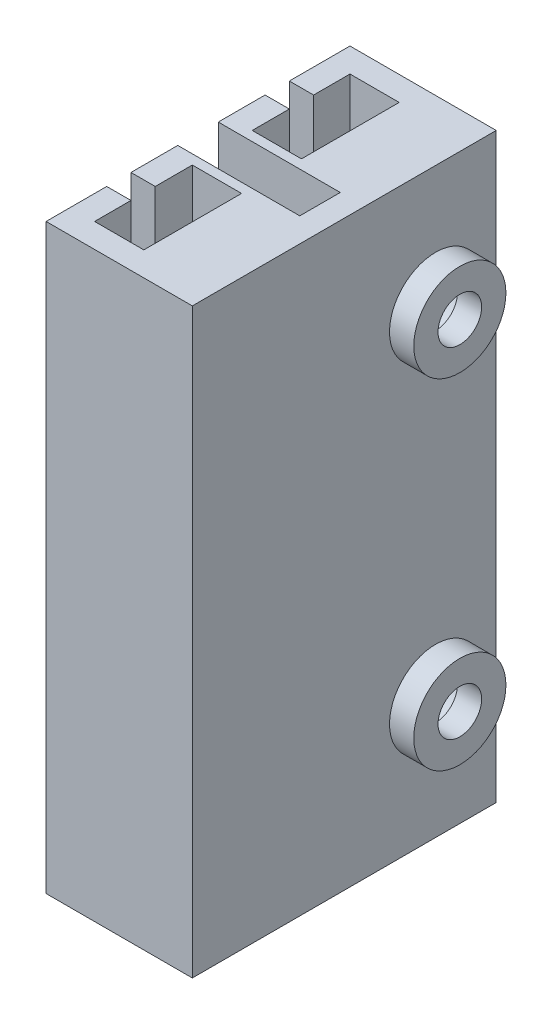
ISO-10303-21;
HEADER;
FILE_DESCRIPTION(('STEP AP214'),'2;1');
FILE_NAME('part.step','',(''),(''),'','','');
FILE_SCHEMA(('AUTOMOTIVE_DESIGN { 1 0 10303 214 1 1 1 1 }'));
ENDSEC;
DATA;
#1=APPLICATION_CONTEXT('core data for automotive mechanical design processes');
#2=APPLICATION_PROTOCOL_DEFINITION('international standard','automotive_design',2000,#1);
#3=PRODUCT_CONTEXT('',#1,'mechanical');
#4=PRODUCT('Part','Part','',(#3));
#5=PRODUCT_RELATED_PRODUCT_CATEGORY('part','',(#4));
#6=PRODUCT_DEFINITION_FORMATION('','',#4);
#7=PRODUCT_DEFINITION_CONTEXT('part definition',#1,'design');
#8=PRODUCT_DEFINITION('design','',#6,#7);
#9=PRODUCT_DEFINITION_SHAPE('','',#8);
#10=(LENGTH_UNIT() NAMED_UNIT(*) SI_UNIT(.MILLI.,.METRE.));
#11=(NAMED_UNIT(*) PLANE_ANGLE_UNIT() SI_UNIT($,.RADIAN.));
#12=(NAMED_UNIT(*) SI_UNIT($,.STERADIAN.) SOLID_ANGLE_UNIT());
#13=UNCERTAINTY_MEASURE_WITH_UNIT(LENGTH_MEASURE(1.E-05),#10,'distance_accuracy_value','');
#14=(GEOMETRIC_REPRESENTATION_CONTEXT(3) GLOBAL_UNCERTAINTY_ASSIGNED_CONTEXT((#13)) GLOBAL_UNIT_ASSIGNED_CONTEXT((#10,
#11,#12)) REPRESENTATION_CONTEXT('',''));
#15=CARTESIAN_POINT('',(0.,0.,0.));
#16=DIRECTION('',(0.,0.,1.));
#17=DIRECTION('',(1.,0.,0.));
#18=AXIS2_PLACEMENT_3D('',#15,#16,#17);
#19=CARTESIAN_POINT('',(-1.03,24.,-5.315));
#20=DIRECTION('',(1.,0.,0.));
#21=DIRECTION('',(0.,0.,-1.));
#22=AXIS2_PLACEMENT_3D('',#19,#20,#21);
#23=PLANE('',#22);
#24=DIRECTION('',(0.,0.,1.));
#25=VECTOR('',#24,1.);
#26=CARTESIAN_POINT('',(-1.03,0.,-5.315));
#27=LINE('',#26,#25);
#28=CARTESIAN_POINT('',(-1.03,0.,-5.315));
#29=VERTEX_POINT('',#28);
#30=CARTESIAN_POINT('',(-1.03,0.,-2.815));
#31=VERTEX_POINT('',#30);
#32=EDGE_CURVE('E209',#29,#31,#27,.T.);
#33=ORIENTED_EDGE('',*,*,#32,.T.);
#34=DIRECTION('',(0.,-1.,0.));
#35=VECTOR('',#34,1.);
#36=CARTESIAN_POINT('',(-1.03,24.,-2.815));
#37=LINE('',#36,#35);
#38=CARTESIAN_POINT('',(-1.03,24.,-2.815));
#39=VERTEX_POINT('',#38);
#40=EDGE_CURVE('E194',#39,#31,#37,.T.);
#41=ORIENTED_EDGE('',*,*,#40,.F.);
#42=DIRECTION('',(0.,0.,1.));
#43=VECTOR('',#42,1.);
#44=CARTESIAN_POINT('',(-1.03,24.,-5.315));
#45=LINE('',#44,#43);
#46=CARTESIAN_POINT('',(-1.03,24.,-5.315));
#47=VERTEX_POINT('',#46);
#48=EDGE_CURVE('E390',#47,#39,#45,.T.);
#49=ORIENTED_EDGE('',*,*,#48,.F.);
#50=DIRECTION('',(0.,-1.,0.));
#51=VECTOR('',#50,1.);
#52=CARTESIAN_POINT('',(-1.03,24.,-5.315));
#53=LINE('',#52,#51);
#54=EDGE_CURVE('E216',#47,#29,#53,.T.);
#55=ORIENTED_EDGE('',*,*,#54,.T.);
#56=EDGE_LOOP('',(#33,#41,#49,#55));
#57=FACE_BOUND('',#56,.T.);
#58=ADVANCED_FACE('F33',(#57),#23,.F.);
#59=CARTESIAN_POINT('',(-1.03,24.,1.785));
#60=DIRECTION('',(1.,0.,0.));
#61=DIRECTION('',(0.,0.,-1.));
#62=AXIS2_PLACEMENT_3D('',#59,#60,#61);
#63=PLANE('',#62);
#64=DIRECTION('',(0.,0.,1.));
#65=VECTOR('',#64,1.);
#66=CARTESIAN_POINT('',(-1.03,0.,1.785));
#67=LINE('',#66,#65);
#68=CARTESIAN_POINT('',(-1.03,0.,1.785));
#69=VERTEX_POINT('',#68);
#70=CARTESIAN_POINT('',(-1.03,0.,3.715));
#71=VERTEX_POINT('',#70);
#72=EDGE_CURVE('E230',#69,#71,#67,.T.);
#73=ORIENTED_EDGE('',*,*,#72,.T.);
#74=DIRECTION('',(0.,-1.,0.));
#75=VECTOR('',#74,1.);
#76=CARTESIAN_POINT('',(-1.03,24.,3.715));
#77=LINE('',#76,#75);
#78=CARTESIAN_POINT('',(-1.03,24.,3.715));
#79=VERTEX_POINT('',#78);
#80=EDGE_CURVE('E299',#79,#71,#77,.T.);
#81=ORIENTED_EDGE('',*,*,#80,.F.);
#82=DIRECTION('',(0.,0.,1.));
#83=VECTOR('',#82,1.);
#84=CARTESIAN_POINT('',(-1.03,24.,1.785));
#85=LINE('',#84,#83);
#86=CARTESIAN_POINT('',(-1.03,24.,1.785));
#87=VERTEX_POINT('',#86);
#88=EDGE_CURVE('E240',#87,#79,#85,.T.);
#89=ORIENTED_EDGE('',*,*,#88,.F.);
#90=DIRECTION('',(0.,-1.,0.));
#91=VECTOR('',#90,1.);
#92=CARTESIAN_POINT('',(-1.03,24.,1.785));
#93=LINE('',#92,#91);
#94=EDGE_CURVE('E239',#87,#69,#93,.T.);
#95=ORIENTED_EDGE('',*,*,#94,.T.);
#96=EDGE_LOOP('',(#73,#81,#89,#95));
#97=FACE_BOUND('',#96,.T.);
#98=ADVANCED_FACE('F452',(#97),#63,.F.);
#99=CARTESIAN_POINT('',(-0.0300000000000005,24.,-4.315));
#100=DIRECTION('',(1.,0.,0.));
#101=DIRECTION('',(0.,0.,-1.));
#102=AXIS2_PLACEMENT_3D('',#99,#100,#101);
#103=PLANE('',#102);
#104=DIRECTION('',(0.,1.,0.));
#105=VECTOR('',#104,1.);
#106=CARTESIAN_POINT('',(-0.0300000000000003,24.,-2.815));
#107=LINE('',#106,#105);
#108=CARTESIAN_POINT('',(-0.0300000000000003,0.,-2.815));
#109=VERTEX_POINT('',#108);
#110=CARTESIAN_POINT('',(-0.0300000000000003,24.,-2.815));
#111=VERTEX_POINT('',#110);
#112=EDGE_CURVE('E265',#109,#111,#107,.T.);
#113=ORIENTED_EDGE('',*,*,#112,.F.);
#114=DIRECTION('',(0.,0.,1.));
#115=VECTOR('',#114,1.);
#116=CARTESIAN_POINT('',(-0.0300000000000005,0.,-4.315));
#117=LINE('',#116,#115);
#118=CARTESIAN_POINT('',(-0.0300000000000005,0.,-4.315));
#119=VERTEX_POINT('',#118);
#120=EDGE_CURVE('E211',#119,#109,#117,.T.);
#121=ORIENTED_EDGE('',*,*,#120,.F.);
#122=DIRECTION('',(0.,-1.,0.));
#123=VECTOR('',#122,1.);
#124=CARTESIAN_POINT('',(-0.0300000000000005,24.,-4.315));
#125=LINE('',#124,#123);
#126=CARTESIAN_POINT('',(-0.0300000000000005,24.,-4.315));
#127=VERTEX_POINT('',#126);
#128=EDGE_CURVE('E363',#127,#119,#125,.T.);
#129=ORIENTED_EDGE('',*,*,#128,.F.);
#130=DIRECTION('',(0.,0.,1.));
#131=VECTOR('',#130,1.);
#132=CARTESIAN_POINT('',(-0.0300000000000005,24.,-4.315));
#133=LINE('',#132,#131);
#134=EDGE_CURVE('E352',#127,#111,#133,.T.);
#135=ORIENTED_EDGE('',*,*,#134,.T.);
#136=EDGE_LOOP('',(#113,#121,#129,#135));
#137=FACE_BOUND('',#136,.T.);
#138=ADVANCED_FACE('F498',(#137),#103,.T.);
#139=CARTESIAN_POINT('',(-0.0299999999999997,24.,2.185));
#140=DIRECTION('',(1.,0.,0.));
#141=DIRECTION('',(0.,0.,-1.));
#142=AXIS2_PLACEMENT_3D('',#139,#140,#141);
#143=PLANE('',#142);
#144=DIRECTION('',(0.,1.,0.));
#145=VECTOR('',#144,1.);
#146=CARTESIAN_POINT('',(-0.0299999999999995,24.,3.715));
#147=LINE('',#146,#145);
#148=CARTESIAN_POINT('',(-0.0299999999999995,0.,3.715));
#149=VERTEX_POINT('',#148);
#150=CARTESIAN_POINT('',(-0.0299999999999994,24.,3.715));
#151=VERTEX_POINT('',#150);
#152=EDGE_CURVE('E261',#149,#151,#147,.T.);
#153=ORIENTED_EDGE('',*,*,#152,.F.);
#154=DIRECTION('',(0.,0.,1.));
#155=VECTOR('',#154,1.);
#156=CARTESIAN_POINT('',(-0.0299999999999997,0.,2.185));
#157=LINE('',#156,#155);
#158=CARTESIAN_POINT('',(-0.0299999999999997,0.,2.185));
#159=VERTEX_POINT('',#158);
#160=EDGE_CURVE('E330',#159,#149,#157,.T.);
#161=ORIENTED_EDGE('',*,*,#160,.F.);
#162=DIRECTION('',(0.,-1.,0.));
#163=VECTOR('',#162,1.);
#164=CARTESIAN_POINT('',(-0.0299999999999997,24.,2.185));
#165=LINE('',#164,#163);
#166=CARTESIAN_POINT('',(-0.0299999999999997,24.,2.185));
#167=VERTEX_POINT('',#166);
#168=EDGE_CURVE('E329',#167,#159,#165,.T.);
#169=ORIENTED_EDGE('',*,*,#168,.F.);
#170=DIRECTION('',(0.,0.,1.));
#171=VECTOR('',#170,1.);
#172=CARTESIAN_POINT('',(-0.0299999999999997,24.,2.185));
#173=LINE('',#172,#171);
#174=EDGE_CURVE('E318',#167,#151,#173,.T.);
#175=ORIENTED_EDGE('',*,*,#174,.T.);
#176=EDGE_LOOP('',(#153,#161,#169,#175));
#177=FACE_BOUND('',#176,.T.);
#178=ADVANCED_FACE('F445',(#177),#143,.T.);
#179=CARTESIAN_POINT('',(0.,24.,0.));
#180=DIRECTION('',(0.,1.,0.));
#181=DIRECTION('',(0.,0.,1.));
#182=AXIS2_PLACEMENT_3D('',#179,#180,#181);
#183=PLANE('',#182);
#184=DIRECTION('',(-1.,0.,0.));
#185=VECTOR('',#184,1.);
#186=CARTESIAN_POINT('',(0.97,24.,-2.815));
#187=LINE('',#186,#185);
#188=EDGE_CURVE('E197',#111,#39,#187,.T.);
#189=ORIENTED_EDGE('',*,*,#188,.F.);
#190=ORIENTED_EDGE('',*,*,#134,.F.);
#191=DIRECTION('',(-1.,0.,0.));
#192=VECTOR('',#191,1.);
#193=CARTESIAN_POINT('',(-0.0300000000000005,24.,-4.315));
#194=LINE('',#193,#192);
#195=CARTESIAN_POINT('',(2.,24.,-4.315));
#196=VERTEX_POINT('',#195);
#197=EDGE_CURVE('E361',#196,#127,#194,.T.);
#198=ORIENTED_EDGE('',*,*,#197,.F.);
#199=DIRECTION('',(0.,0.,-1.));
#200=VECTOR('',#199,1.);
#201=CARTESIAN_POINT('',(2.,24.,-4.315));
#202=LINE('',#201,#200);
#203=CARTESIAN_POINT('',(2.,24.,-0.285));
#204=VERTEX_POINT('',#203);
#205=EDGE_CURVE('E358',#204,#196,#202,.T.);
#206=ORIENTED_EDGE('',*,*,#205,.F.);
#207=DIRECTION('',(1.,0.,0.));
#208=VECTOR('',#207,1.);
#209=CARTESIAN_POINT('',(-0.03,24.,-0.285));
#210=LINE('',#209,#208);
#211=CARTESIAN_POINT('',(-0.03,24.,-0.285));
#212=VERTEX_POINT('',#211);
#213=EDGE_CURVE('E355',#212,#204,#210,.T.);
#214=ORIENTED_EDGE('',*,*,#213,.F.);
#215=CARTESIAN_POINT('',(-0.0300000000000002,24.,-1.815));
#216=VERTEX_POINT('',#215);
#217=EDGE_CURVE('E356',#216,#212,#133,.T.);
#218=ORIENTED_EDGE('',*,*,#217,.F.);
#219=DIRECTION('',(-1.,0.,0.));
#220=VECTOR('',#219,1.);
#221=CARTESIAN_POINT('',(0.97,24.,-1.815));
#222=LINE('',#221,#220);
#223=CARTESIAN_POINT('',(-1.03,24.,-1.815));
#224=VERTEX_POINT('',#223);
#225=EDGE_CURVE('E50',#216,#224,#222,.T.);
#226=ORIENTED_EDGE('',*,*,#225,.T.);
#227=CARTESIAN_POINT('',(-1.03,24.,0.115));
#228=VERTEX_POINT('',#227);
#229=EDGE_CURVE('E389',#224,#228,#45,.T.);
#230=ORIENTED_EDGE('',*,*,#229,.T.);
#231=DIRECTION('',(1.,0.,0.));
#232=VECTOR('',#231,1.);
#233=CARTESIAN_POINT('',(-1.03,24.,0.115));
#234=LINE('',#233,#232);
#235=CARTESIAN_POINT('',(4.,24.,0.115));
#236=VERTEX_POINT('',#235);
#237=EDGE_CURVE('E392',#228,#236,#234,.T.);
#238=ORIENTED_EDGE('',*,*,#237,.T.);
#239=DIRECTION('',(0.,0.,1.));
#240=VECTOR('',#239,1.);
#241=CARTESIAN_POINT('',(4.,24.,0.115));
#242=LINE('',#241,#240);
#243=CARTESIAN_POINT('',(4.,24.,1.785));
#244=VERTEX_POINT('',#243);
#245=EDGE_CURVE('E394',#236,#244,#242,.T.);
#246=ORIENTED_EDGE('',*,*,#245,.T.);
#247=DIRECTION('',(-1.,0.,0.));
#248=VECTOR('',#247,1.);
#249=CARTESIAN_POINT('',(-1.03,24.,1.785));
#250=LINE('',#249,#248);
#251=EDGE_CURVE('E396',#244,#87,#250,.T.);
#252=ORIENTED_EDGE('',*,*,#251,.T.);
#253=ORIENTED_EDGE('',*,*,#88,.T.);
#254=DIRECTION('',(-1.,0.,0.));
#255=VECTOR('',#254,1.);
#256=CARTESIAN_POINT('',(0.97,24.,3.715));
#257=LINE('',#256,#255);
#258=EDGE_CURVE('E203',#151,#79,#257,.T.);
#259=ORIENTED_EDGE('',*,*,#258,.F.);
#260=ORIENTED_EDGE('',*,*,#174,.F.);
#261=DIRECTION('',(-1.,0.,0.));
#262=VECTOR('',#261,1.);
#263=CARTESIAN_POINT('',(-0.0299999999999997,24.,2.185));
#264=LINE('',#263,#262);
#265=CARTESIAN_POINT('',(2.,24.,2.185));
#266=VERTEX_POINT('',#265);
#267=EDGE_CURVE('E327',#266,#167,#264,.T.);
#268=ORIENTED_EDGE('',*,*,#267,.F.);
#269=DIRECTION('',(0.,0.,-1.));
#270=VECTOR('',#269,1.);
#271=CARTESIAN_POINT('',(2.,24.,2.185));
#272=LINE('',#271,#270);
#273=CARTESIAN_POINT('',(2.,24.,6.215));
#274=VERTEX_POINT('',#273);
#275=EDGE_CURVE('E324',#274,#266,#272,.T.);
#276=ORIENTED_EDGE('',*,*,#275,.F.);
#277=DIRECTION('',(1.,0.,0.));
#278=VECTOR('',#277,1.);
#279=CARTESIAN_POINT('',(-0.0299999999999992,24.,6.215));
#280=LINE('',#279,#278);
#281=CARTESIAN_POINT('',(-0.0299999999999992,24.,6.215));
#282=VERTEX_POINT('',#281);
#283=EDGE_CURVE('E321',#282,#274,#280,.T.);
#284=ORIENTED_EDGE('',*,*,#283,.F.);
#285=CARTESIAN_POINT('',(-0.0299999999999994,24.,4.715));
#286=VERTEX_POINT('',#285);
#287=EDGE_CURVE('E322',#286,#282,#173,.T.);
#288=ORIENTED_EDGE('',*,*,#287,.F.);
#289=DIRECTION('',(-1.,0.,0.));
#290=VECTOR('',#289,1.);
#291=CARTESIAN_POINT('',(0.97,24.,4.715));
#292=LINE('',#291,#290);
#293=CARTESIAN_POINT('',(-1.03,24.,4.715));
#294=VERTEX_POINT('',#293);
#295=EDGE_CURVE('E311',#286,#294,#292,.T.);
#296=ORIENTED_EDGE('',*,*,#295,.T.);
#297=CARTESIAN_POINT('',(-1.03,24.,7.215));
#298=VERTEX_POINT('',#297);
#299=EDGE_CURVE('E398',#294,#298,#85,.T.);
#300=ORIENTED_EDGE('',*,*,#299,.T.);
#301=DIRECTION('',(1.,0.,0.));
#302=VECTOR('',#301,1.);
#303=CARTESIAN_POINT('',(5.,24.,7.215));
#304=LINE('',#303,#302);
#305=CARTESIAN_POINT('',(5.,24.,7.215));
#306=VERTEX_POINT('',#305);
#307=EDGE_CURVE('E235',#298,#306,#304,.T.);
#308=ORIENTED_EDGE('',*,*,#307,.T.);
#309=DIRECTION('',(0.,0.,-1.));
#310=VECTOR('',#309,1.);
#311=CARTESIAN_POINT('',(5.,24.,-5.315));
#312=LINE('',#311,#310);
#313=CARTESIAN_POINT('',(5.,24.,-5.315));
#314=VERTEX_POINT('',#313);
#315=EDGE_CURVE('E385',#306,#314,#312,.T.);
#316=ORIENTED_EDGE('',*,*,#315,.T.);
#317=DIRECTION('',(-1.,0.,0.));
#318=VECTOR('',#317,1.);
#319=CARTESIAN_POINT('',(0.758759528759529,24.,-5.315));
#320=LINE('',#319,#318);
#321=EDGE_CURVE('E387',#314,#47,#320,.T.);
#322=ORIENTED_EDGE('',*,*,#321,.T.);
#323=ORIENTED_EDGE('',*,*,#48,.T.);
#324=EDGE_LOOP('',(#189,#190,#198,#206,#214,#218,#226,#230,#238,#246,#252,#253,#259,#260,#268,
#276,#284,#288,#296,#300,#308,#316,#322,#323));
#325=FACE_BOUND('',#324,.T.);
#326=ADVANCED_FACE('F433',(#325),#183,.T.);
#327=CARTESIAN_POINT('',(0.,0.,0.));
#328=DIRECTION('',(0.,1.,0.));
#329=DIRECTION('',(0.,0.,1.));
#330=AXIS2_PLACEMENT_3D('',#327,#328,#329);
#331=PLANE('',#330);
#332=ORIENTED_EDGE('',*,*,#120,.T.);
#333=DIRECTION('',(-1.,0.,0.));
#334=VECTOR('',#333,1.);
#335=CARTESIAN_POINT('',(0.97,0.,-2.815));
#336=LINE('',#335,#334);
#337=EDGE_CURVE('E58',#109,#31,#336,.T.);
#338=ORIENTED_EDGE('',*,*,#337,.T.);
#339=ORIENTED_EDGE('',*,*,#32,.F.);
#340=DIRECTION('',(-1.,0.,0.));
#341=VECTOR('',#340,1.);
#342=CARTESIAN_POINT('',(-1.03,0.,-5.315));
#343=LINE('',#342,#341);
#344=CARTESIAN_POINT('',(5.,0.,-5.315));
#345=VERTEX_POINT('',#344);
#346=EDGE_CURVE('E222',#345,#29,#343,.T.);
#347=ORIENTED_EDGE('',*,*,#346,.F.);
#348=DIRECTION('',(0.,0.,-1.));
#349=VECTOR('',#348,1.);
#350=CARTESIAN_POINT('',(5.,0.,-5.315));
#351=LINE('',#350,#349);
#352=CARTESIAN_POINT('',(5.,0.,7.215));
#353=VERTEX_POINT('',#352);
#354=EDGE_CURVE('E382',#353,#345,#351,.T.);
#355=ORIENTED_EDGE('',*,*,#354,.F.);
#356=DIRECTION('',(1.,0.,0.));
#357=VECTOR('',#356,1.);
#358=CARTESIAN_POINT('',(-1.03,0.,7.215));
#359=LINE('',#358,#357);
#360=CARTESIAN_POINT('',(-1.03,0.,7.215));
#361=VERTEX_POINT('',#360);
#362=EDGE_CURVE('E233',#361,#353,#359,.T.);
#363=ORIENTED_EDGE('',*,*,#362,.F.);
#364=CARTESIAN_POINT('',(-1.03,0.,4.715));
#365=VERTEX_POINT('',#364);
#366=EDGE_CURVE('E229',#365,#361,#67,.T.);
#367=ORIENTED_EDGE('',*,*,#366,.F.);
#368=DIRECTION('',(-1.,0.,0.));
#369=VECTOR('',#368,1.);
#370=CARTESIAN_POINT('',(0.97,0.,4.715));
#371=LINE('',#370,#369);
#372=CARTESIAN_POINT('',(-0.0299999999999994,0.,4.715));
#373=VERTEX_POINT('',#372);
#374=EDGE_CURVE('E314',#373,#365,#371,.T.);
#375=ORIENTED_EDGE('',*,*,#374,.F.);
#376=CARTESIAN_POINT('',(-0.0299999999999992,0.,6.215));
#377=VERTEX_POINT('',#376);
#378=EDGE_CURVE('E303',#373,#377,#157,.T.);
#379=ORIENTED_EDGE('',*,*,#378,.T.);
#380=DIRECTION('',(1.,0.,0.));
#381=VECTOR('',#380,1.);
#382=CARTESIAN_POINT('',(-0.0299999999999992,0.,6.215));
#383=LINE('',#382,#381);
#384=CARTESIAN_POINT('',(2.,0.,6.215));
#385=VERTEX_POINT('',#384);
#386=EDGE_CURVE('E333',#377,#385,#383,.T.);
#387=ORIENTED_EDGE('',*,*,#386,.T.);
#388=DIRECTION('',(0.,0.,-1.));
#389=VECTOR('',#388,1.);
#390=CARTESIAN_POINT('',(2.,0.,2.185));
#391=LINE('',#390,#389);
#392=CARTESIAN_POINT('',(2.,0.,2.185));
#393=VERTEX_POINT('',#392);
#394=EDGE_CURVE('E336',#385,#393,#391,.T.);
#395=ORIENTED_EDGE('',*,*,#394,.T.);
#396=DIRECTION('',(-1.,0.,0.));
#397=VECTOR('',#396,1.);
#398=CARTESIAN_POINT('',(-0.0299999999999997,0.,2.185));
#399=LINE('',#398,#397);
#400=EDGE_CURVE('E339',#393,#159,#399,.T.);
#401=ORIENTED_EDGE('',*,*,#400,.T.);
#402=ORIENTED_EDGE('',*,*,#160,.T.);
#403=DIRECTION('',(-1.,0.,0.));
#404=VECTOR('',#403,1.);
#405=CARTESIAN_POINT('',(0.97,0.,3.715));
#406=LINE('',#405,#404);
#407=EDGE_CURVE('E309',#149,#71,#406,.T.);
#408=ORIENTED_EDGE('',*,*,#407,.T.);
#409=ORIENTED_EDGE('',*,*,#72,.F.);
#410=DIRECTION('',(-1.,0.,0.));
#411=VECTOR('',#410,1.);
#412=CARTESIAN_POINT('',(-1.03,0.,1.785));
#413=LINE('',#412,#411);
#414=CARTESIAN_POINT('',(4.,0.,1.785));
#415=VERTEX_POINT('',#414);
#416=EDGE_CURVE('E227',#415,#69,#413,.T.);
#417=ORIENTED_EDGE('',*,*,#416,.F.);
#418=DIRECTION('',(0.,0.,1.));
#419=VECTOR('',#418,1.);
#420=CARTESIAN_POINT('',(4.,0.,0.115));
#421=LINE('',#420,#419);
#422=CARTESIAN_POINT('',(4.,0.,0.115));
#423=VERTEX_POINT('',#422);
#424=EDGE_CURVE('E220',#423,#415,#421,.T.);
#425=ORIENTED_EDGE('',*,*,#424,.F.);
#426=DIRECTION('',(1.,0.,0.));
#427=VECTOR('',#426,1.);
#428=CARTESIAN_POINT('',(-1.03,0.,0.115));
#429=LINE('',#428,#427);
#430=CARTESIAN_POINT('',(-1.03,0.,0.115));
#431=VERTEX_POINT('',#430);
#432=EDGE_CURVE('E217',#431,#423,#429,.T.);
#433=ORIENTED_EDGE('',*,*,#432,.F.);
#434=CARTESIAN_POINT('',(-1.03,0.,-1.815));
#435=VERTEX_POINT('',#434);
#436=EDGE_CURVE('E218',#435,#431,#27,.T.);
#437=ORIENTED_EDGE('',*,*,#436,.F.);
#438=DIRECTION('',(-1.,0.,0.));
#439=VECTOR('',#438,1.);
#440=CARTESIAN_POINT('',(0.97,0.,-1.815));
#441=LINE('',#440,#439);
#442=CARTESIAN_POINT('',(-0.0300000000000003,0.,-1.815));
#443=VERTEX_POINT('',#442);
#444=EDGE_CURVE('E212',#443,#435,#441,.T.);
#445=ORIENTED_EDGE('',*,*,#444,.F.);
#446=CARTESIAN_POINT('',(-0.03,0.,-0.285));
#447=VERTEX_POINT('',#446);
#448=EDGE_CURVE('E351',#443,#447,#117,.T.);
#449=ORIENTED_EDGE('',*,*,#448,.T.);
#450=DIRECTION('',(1.,0.,0.));
#451=VECTOR('',#450,1.);
#452=CARTESIAN_POINT('',(-0.03,0.,-0.285));
#453=LINE('',#452,#451);
#454=CARTESIAN_POINT('',(2.,0.,-0.285));
#455=VERTEX_POINT('',#454);
#456=EDGE_CURVE('E365',#447,#455,#453,.T.);
#457=ORIENTED_EDGE('',*,*,#456,.T.);
#458=DIRECTION('',(0.,0.,-1.));
#459=VECTOR('',#458,1.);
#460=CARTESIAN_POINT('',(2.,0.,-4.315));
#461=LINE('',#460,#459);
#462=CARTESIAN_POINT('',(2.,0.,-4.315));
#463=VERTEX_POINT('',#462);
#464=EDGE_CURVE('E368',#455,#463,#461,.T.);
#465=ORIENTED_EDGE('',*,*,#464,.T.);
#466=DIRECTION('',(-1.,0.,0.));
#467=VECTOR('',#466,1.);
#468=CARTESIAN_POINT('',(-0.0300000000000005,0.,-4.315));
#469=LINE('',#468,#467);
#470=EDGE_CURVE('E371',#463,#119,#469,.T.);
#471=ORIENTED_EDGE('',*,*,#470,.T.);
#472=EDGE_LOOP('',(#332,#338,#339,#347,#355,#363,#367,#375,#379,#387,#395,#401,#402,#408,#409,
#417,#425,#433,#437,#445,#449,#457,#465,#471));
#473=FACE_BOUND('',#472,.T.);
#474=ADVANCED_FACE('F208',(#473),#331,.F.);
#475=CARTESIAN_POINT('',(5.,24.,-5.315));
#476=DIRECTION('',(-1.,0.,0.));
#477=DIRECTION('',(0.,0.,1.));
#478=AXIS2_PLACEMENT_3D('',#475,#476,#477);
#479=PLANE('',#478);
#480=CARTESIAN_POINT('',(5.,19.,-2.815));
#481=DIRECTION('',(-1.,0.,0.));
#482=DIRECTION('',(0.,0.,1.));
#483=AXIS2_PLACEMENT_3D('',#480,#481,#482);
#484=CIRCLE('',#483,1.9);
#485=CARTESIAN_POINT('',(5.,19.,-0.915000000000002));
#486=VERTEX_POINT('',#485);
#487=EDGE_CURVE('E11',#486,#486,#484,.F.);
#488=ORIENTED_EDGE('',*,*,#487,.F.);
#489=EDGE_LOOP('',(#488));
#490=FACE_BOUND('',#489,.T.);
#491=CARTESIAN_POINT('',(5.,5.,-2.815));
#492=DIRECTION('',(-1.,0.,0.));
#493=DIRECTION('',(0.,0.,1.));
#494=AXIS2_PLACEMENT_3D('',#491,#492,#493);
#495=CIRCLE('',#494,1.9);
#496=CARTESIAN_POINT('',(5.,5.,-0.915));
#497=VERTEX_POINT('',#496);
#498=EDGE_CURVE('E42',#497,#497,#495,.F.);
#499=ORIENTED_EDGE('',*,*,#498,.F.);
#500=EDGE_LOOP('',(#499));
#501=FACE_BOUND('',#500,.T.);
#502=ORIENTED_EDGE('',*,*,#354,.T.);
#503=DIRECTION('',(0.,-1.,0.));
#504=VECTOR('',#503,1.);
#505=CARTESIAN_POINT('',(5.,24.,-5.315));
#506=LINE('',#505,#504);
#507=EDGE_CURVE('E253',#314,#345,#506,.T.);
#508=ORIENTED_EDGE('',*,*,#507,.F.);
#509=ORIENTED_EDGE('',*,*,#315,.F.);
#510=DIRECTION('',(0.,-1.,0.));
#511=VECTOR('',#510,1.);
#512=CARTESIAN_POINT('',(5.,24.,7.215));
#513=LINE('',#512,#511);
#514=EDGE_CURVE('E256',#306,#353,#513,.T.);
#515=ORIENTED_EDGE('',*,*,#514,.T.);
#516=EDGE_LOOP('',(#502,#508,#509,#515));
#517=FACE_BOUND('',#516,.T.);
#518=ADVANCED_FACE('F35',(#490,#501,#517),#479,.F.);
#519=CARTESIAN_POINT('',(-1.03,24.,-5.315));
#520=DIRECTION('',(0.,0.,1.));
#521=DIRECTION('',(1.,0.,0.));
#522=AXIS2_PLACEMENT_3D('',#519,#520,#521);
#523=PLANE('',#522);
#524=ORIENTED_EDGE('',*,*,#346,.T.);
#525=ORIENTED_EDGE('',*,*,#54,.F.);
#526=ORIENTED_EDGE('',*,*,#321,.F.);
#527=ORIENTED_EDGE('',*,*,#507,.T.);
#528=EDGE_LOOP('',(#524,#525,#526,#527));
#529=FACE_BOUND('',#528,.T.);
#530=ADVANCED_FACE('F405',(#529),#523,.F.);
#531=ORIENTED_EDGE('',*,*,#229,.F.);
#532=DIRECTION('',(0.,1.,0.));
#533=VECTOR('',#532,1.);
#534=CARTESIAN_POINT('',(-1.03,24.,-1.815));
#535=LINE('',#534,#533);
#536=EDGE_CURVE('E202',#435,#224,#535,.T.);
#537=ORIENTED_EDGE('',*,*,#536,.F.);
#538=ORIENTED_EDGE('',*,*,#436,.T.);
#539=DIRECTION('',(0.,-1.,0.));
#540=VECTOR('',#539,1.);
#541=CARTESIAN_POINT('',(-1.03,24.,0.115));
#542=LINE('',#541,#540);
#543=EDGE_CURVE('E249',#228,#431,#542,.T.);
#544=ORIENTED_EDGE('',*,*,#543,.F.);
#545=EDGE_LOOP('',(#531,#537,#538,#544));
#546=FACE_BOUND('',#545,.T.);
#547=ADVANCED_FACE('F476',(#546),#23,.F.);
#548=CARTESIAN_POINT('',(-1.03,24.,0.115));
#549=DIRECTION('',(0.,0.,-1.));
#550=DIRECTION('',(-1.,0.,0.));
#551=AXIS2_PLACEMENT_3D('',#548,#549,#550);
#552=PLANE('',#551);
#553=ORIENTED_EDGE('',*,*,#432,.T.);
#554=DIRECTION('',(0.,-1.,0.));
#555=VECTOR('',#554,1.);
#556=CARTESIAN_POINT('',(4.,24.,0.115));
#557=LINE('',#556,#555);
#558=EDGE_CURVE('E246',#236,#423,#557,.T.);
#559=ORIENTED_EDGE('',*,*,#558,.F.);
#560=ORIENTED_EDGE('',*,*,#237,.F.);
#561=ORIENTED_EDGE('',*,*,#543,.T.);
#562=EDGE_LOOP('',(#553,#559,#560,#561));
#563=FACE_BOUND('',#562,.T.);
#564=ADVANCED_FACE('F468',(#563),#552,.F.);
#565=CARTESIAN_POINT('',(4.,24.,0.115));
#566=DIRECTION('',(1.,0.,0.));
#567=DIRECTION('',(0.,0.,-1.));
#568=AXIS2_PLACEMENT_3D('',#565,#566,#567);
#569=PLANE('',#568);
#570=ORIENTED_EDGE('',*,*,#424,.T.);
#571=DIRECTION('',(0.,-1.,0.));
#572=VECTOR('',#571,1.);
#573=CARTESIAN_POINT('',(4.,24.,1.785));
#574=LINE('',#573,#572);
#575=EDGE_CURVE('E243',#244,#415,#574,.T.);
#576=ORIENTED_EDGE('',*,*,#575,.F.);
#577=ORIENTED_EDGE('',*,*,#245,.F.);
#578=ORIENTED_EDGE('',*,*,#558,.T.);
#579=EDGE_LOOP('',(#570,#576,#577,#578));
#580=FACE_BOUND('',#579,.T.);
#581=ADVANCED_FACE('F464',(#580),#569,.F.);
#582=CARTESIAN_POINT('',(-1.03,24.,1.785));
#583=DIRECTION('',(0.,0.,1.));
#584=DIRECTION('',(1.,0.,0.));
#585=AXIS2_PLACEMENT_3D('',#582,#583,#584);
#586=PLANE('',#585);
#587=ORIENTED_EDGE('',*,*,#416,.T.);
#588=ORIENTED_EDGE('',*,*,#94,.F.);
#589=ORIENTED_EDGE('',*,*,#251,.F.);
#590=ORIENTED_EDGE('',*,*,#575,.T.);
#591=EDGE_LOOP('',(#587,#588,#589,#590));
#592=FACE_BOUND('',#591,.T.);
#593=ADVANCED_FACE('F459',(#592),#586,.F.);
#594=ORIENTED_EDGE('',*,*,#299,.F.);
#595=DIRECTION('',(0.,1.,0.));
#596=VECTOR('',#595,1.);
#597=CARTESIAN_POINT('',(-1.03,24.,4.715));
#598=LINE('',#597,#596);
#599=EDGE_CURVE('E307',#365,#294,#598,.T.);
#600=ORIENTED_EDGE('',*,*,#599,.F.);
#601=ORIENTED_EDGE('',*,*,#366,.T.);
#602=DIRECTION('',(0.,-1.,0.));
#603=VECTOR('',#602,1.);
#604=CARTESIAN_POINT('',(-1.03,24.,7.215));
#605=LINE('',#604,#603);
#606=EDGE_CURVE('E236',#298,#361,#605,.T.);
#607=ORIENTED_EDGE('',*,*,#606,.F.);
#608=EDGE_LOOP('',(#594,#600,#601,#607));
#609=FACE_BOUND('',#608,.T.);
#610=ADVANCED_FACE('F416',(#609),#63,.F.);
#611=CARTESIAN_POINT('',(-1.03,24.,7.215));
#612=DIRECTION('',(0.,0.,-1.));
#613=DIRECTION('',(-1.,0.,0.));
#614=AXIS2_PLACEMENT_3D('',#611,#612,#613);
#615=PLANE('',#614);
#616=ORIENTED_EDGE('',*,*,#362,.T.);
#617=ORIENTED_EDGE('',*,*,#514,.F.);
#618=ORIENTED_EDGE('',*,*,#307,.F.);
#619=ORIENTED_EDGE('',*,*,#606,.T.);
#620=EDGE_LOOP('',(#616,#617,#618,#619));
#621=FACE_BOUND('',#620,.T.);
#622=ADVANCED_FACE('F412',(#621),#615,.F.);
#623=DIRECTION('',(0.,-1.,0.));
#624=VECTOR('',#623,1.);
#625=CARTESIAN_POINT('',(-0.0300000000000002,24.,-1.815));
#626=LINE('',#625,#624);
#627=EDGE_CURVE('E263',#216,#443,#626,.T.);
#628=ORIENTED_EDGE('',*,*,#627,.F.);
#629=ORIENTED_EDGE('',*,*,#217,.T.);
#630=DIRECTION('',(0.,-1.,0.));
#631=VECTOR('',#630,1.);
#632=CARTESIAN_POINT('',(-0.03,24.,-0.285));
#633=LINE('',#632,#631);
#634=EDGE_CURVE('E379',#212,#447,#633,.T.);
#635=ORIENTED_EDGE('',*,*,#634,.T.);
#636=ORIENTED_EDGE('',*,*,#448,.F.);
#637=EDGE_LOOP('',(#628,#629,#635,#636));
#638=FACE_BOUND('',#637,.T.);
#639=ADVANCED_FACE('F483',(#638),#103,.T.);
#640=CARTESIAN_POINT('',(-0.03,24.,-0.285));
#641=DIRECTION('',(0.,0.,-1.));
#642=DIRECTION('',(-1.,0.,0.));
#643=AXIS2_PLACEMENT_3D('',#640,#641,#642);
#644=PLANE('',#643);
#645=ORIENTED_EDGE('',*,*,#456,.F.);
#646=ORIENTED_EDGE('',*,*,#634,.F.);
#647=ORIENTED_EDGE('',*,*,#213,.T.);
#648=DIRECTION('',(0.,-1.,0.));
#649=VECTOR('',#648,1.);
#650=CARTESIAN_POINT('',(2.,24.,-0.285));
#651=LINE('',#650,#649);
#652=EDGE_CURVE('E377',#204,#455,#651,.T.);
#653=ORIENTED_EDGE('',*,*,#652,.T.);
#654=EDGE_LOOP('',(#645,#646,#647,#653));
#655=FACE_BOUND('',#654,.T.);
#656=ADVANCED_FACE('F486',(#655),#644,.T.);
#657=CARTESIAN_POINT('',(2.,24.,-4.315));
#658=DIRECTION('',(-1.,0.,0.));
#659=DIRECTION('',(0.,0.,1.));
#660=AXIS2_PLACEMENT_3D('',#657,#658,#659);
#661=PLANE('',#660);
#662=CARTESIAN_POINT('',(2.,19.,-2.815));
#663=DIRECTION('',(-1.,0.,0.));
#664=DIRECTION('',(0.,0.,1.));
#665=AXIS2_PLACEMENT_3D('',#662,#663,#664);
#666=CIRCLE('',#665,1.15);
#667=CARTESIAN_POINT('',(2.,19.,-1.665));
#668=VERTEX_POINT('',#667);
#669=EDGE_CURVE('E37',#668,#668,#666,.T.);
#670=ORIENTED_EDGE('',*,*,#669,.F.);
#671=EDGE_LOOP('',(#670));
#672=FACE_BOUND('',#671,.T.);
#673=CARTESIAN_POINT('',(2.,5.,-2.815));
#674=DIRECTION('',(-1.,0.,0.));
#675=DIRECTION('',(0.,0.,1.));
#676=AXIS2_PLACEMENT_3D('',#673,#674,#675);
#677=CIRCLE('',#676,1.15);
#678=CARTESIAN_POINT('',(2.,5.,-1.665));
#679=VERTEX_POINT('',#678);
#680=EDGE_CURVE('E268',#679,#679,#677,.T.);
#681=ORIENTED_EDGE('',*,*,#680,.F.);
#682=EDGE_LOOP('',(#681));
#683=FACE_BOUND('',#682,.T.);
#684=ORIENTED_EDGE('',*,*,#464,.F.);
#685=ORIENTED_EDGE('',*,*,#652,.F.);
#686=ORIENTED_EDGE('',*,*,#205,.T.);
#687=DIRECTION('',(0.,-1.,0.));
#688=VECTOR('',#687,1.);
#689=CARTESIAN_POINT('',(2.,24.,-4.315));
#690=LINE('',#689,#688);
#691=EDGE_CURVE('E375',#196,#463,#690,.T.);
#692=ORIENTED_EDGE('',*,*,#691,.T.);
#693=EDGE_LOOP('',(#684,#685,#686,#692));
#694=FACE_BOUND('',#693,.T.);
#695=ADVANCED_FACE('F491',(#672,#683,#694),#661,.T.);
#696=CARTESIAN_POINT('',(-0.0300000000000005,24.,-4.315));
#697=DIRECTION('',(0.,0.,1.));
#698=DIRECTION('',(1.,0.,0.));
#699=AXIS2_PLACEMENT_3D('',#696,#697,#698);
#700=PLANE('',#699);
#701=ORIENTED_EDGE('',*,*,#470,.F.);
#702=ORIENTED_EDGE('',*,*,#691,.F.);
#703=ORIENTED_EDGE('',*,*,#197,.T.);
#704=ORIENTED_EDGE('',*,*,#128,.T.);
#705=EDGE_LOOP('',(#701,#702,#703,#704));
#706=FACE_BOUND('',#705,.T.);
#707=ADVANCED_FACE('F494',(#706),#700,.T.);
#708=DIRECTION('',(0.,-1.,0.));
#709=VECTOR('',#708,1.);
#710=CARTESIAN_POINT('',(-0.0299999999999994,24.,4.715));
#711=LINE('',#710,#709);
#712=EDGE_CURVE('E259',#286,#373,#711,.T.);
#713=ORIENTED_EDGE('',*,*,#712,.F.);
#714=ORIENTED_EDGE('',*,*,#287,.T.);
#715=DIRECTION('',(0.,-1.,0.));
#716=VECTOR('',#715,1.);
#717=CARTESIAN_POINT('',(-0.0299999999999992,24.,6.215));
#718=LINE('',#717,#716);
#719=EDGE_CURVE('E348',#282,#377,#718,.T.);
#720=ORIENTED_EDGE('',*,*,#719,.T.);
#721=ORIENTED_EDGE('',*,*,#378,.F.);
#722=EDGE_LOOP('',(#713,#714,#720,#721));
#723=FACE_BOUND('',#722,.T.);
#724=ADVANCED_FACE('F424',(#723),#143,.T.);
#725=CARTESIAN_POINT('',(-0.0299999999999992,24.,6.215));
#726=DIRECTION('',(0.,0.,-1.));
#727=DIRECTION('',(-1.,0.,0.));
#728=AXIS2_PLACEMENT_3D('',#725,#726,#727);
#729=PLANE('',#728);
#730=ORIENTED_EDGE('',*,*,#386,.F.);
#731=ORIENTED_EDGE('',*,*,#719,.F.);
#732=ORIENTED_EDGE('',*,*,#283,.T.);
#733=DIRECTION('',(0.,-1.,0.));
#734=VECTOR('',#733,1.);
#735=CARTESIAN_POINT('',(2.,24.,6.215));
#736=LINE('',#735,#734);
#737=EDGE_CURVE('E346',#274,#385,#736,.T.);
#738=ORIENTED_EDGE('',*,*,#737,.T.);
#739=EDGE_LOOP('',(#730,#731,#732,#738));
#740=FACE_BOUND('',#739,.T.);
#741=ADVANCED_FACE('F429',(#740),#729,.T.);
#742=CARTESIAN_POINT('',(2.,24.,2.185));
#743=DIRECTION('',(-1.,0.,0.));
#744=DIRECTION('',(0.,0.,1.));
#745=AXIS2_PLACEMENT_3D('',#742,#743,#744);
#746=PLANE('',#745);
#747=ORIENTED_EDGE('',*,*,#394,.F.);
#748=ORIENTED_EDGE('',*,*,#737,.F.);
#749=ORIENTED_EDGE('',*,*,#275,.T.);
#750=DIRECTION('',(0.,-1.,0.));
#751=VECTOR('',#750,1.);
#752=CARTESIAN_POINT('',(2.,24.,2.185));
#753=LINE('',#752,#751);
#754=EDGE_CURVE('E344',#266,#393,#753,.T.);
#755=ORIENTED_EDGE('',*,*,#754,.T.);
#756=EDGE_LOOP('',(#747,#748,#749,#755));
#757=FACE_BOUND('',#756,.T.);
#758=ADVANCED_FACE('F438',(#757),#746,.T.);
#759=CARTESIAN_POINT('',(-0.0299999999999997,24.,2.185));
#760=DIRECTION('',(0.,0.,1.));
#761=DIRECTION('',(1.,0.,0.));
#762=AXIS2_PLACEMENT_3D('',#759,#760,#761);
#763=PLANE('',#762);
#764=ORIENTED_EDGE('',*,*,#400,.F.);
#765=ORIENTED_EDGE('',*,*,#754,.F.);
#766=ORIENTED_EDGE('',*,*,#267,.T.);
#767=ORIENTED_EDGE('',*,*,#168,.T.);
#768=EDGE_LOOP('',(#764,#765,#766,#767));
#769=FACE_BOUND('',#768,.T.);
#770=ADVANCED_FACE('F441',(#769),#763,.T.);
#771=CARTESIAN_POINT('',(0.97,24.,4.715));
#772=DIRECTION('',(0.,0.,1.));
#773=DIRECTION('',(0.,-1.,0.));
#774=AXIS2_PLACEMENT_3D('',#771,#772,#773);
#775=PLANE('',#774);
#776=ORIENTED_EDGE('',*,*,#712,.T.);
#777=ORIENTED_EDGE('',*,*,#374,.T.);
#778=ORIENTED_EDGE('',*,*,#599,.T.);
#779=ORIENTED_EDGE('',*,*,#295,.F.);
#780=EDGE_LOOP('',(#776,#777,#778,#779));
#781=FACE_BOUND('',#780,.T.);
#782=ADVANCED_FACE('F499',(#781),#775,.F.);
#783=CARTESIAN_POINT('',(0.97,24.,3.715));
#784=DIRECTION('',(0.,0.,-1.));
#785=DIRECTION('',(0.,1.,0.));
#786=AXIS2_PLACEMENT_3D('',#783,#784,#785);
#787=PLANE('',#786);
#788=ORIENTED_EDGE('',*,*,#152,.T.);
#789=ORIENTED_EDGE('',*,*,#258,.T.);
#790=ORIENTED_EDGE('',*,*,#80,.T.);
#791=ORIENTED_EDGE('',*,*,#407,.F.);
#792=EDGE_LOOP('',(#788,#789,#790,#791));
#793=FACE_BOUND('',#792,.T.);
#794=ADVANCED_FACE('F450',(#793),#787,.F.);
#795=CARTESIAN_POINT('',(0.97,24.,-1.815));
#796=DIRECTION('',(0.,0.,1.));
#797=DIRECTION('',(0.,-1.,0.));
#798=AXIS2_PLACEMENT_3D('',#795,#796,#797);
#799=PLANE('',#798);
#800=ORIENTED_EDGE('',*,*,#627,.T.);
#801=ORIENTED_EDGE('',*,*,#444,.T.);
#802=ORIENTED_EDGE('',*,*,#536,.T.);
#803=ORIENTED_EDGE('',*,*,#225,.F.);
#804=EDGE_LOOP('',(#800,#801,#802,#803));
#805=FACE_BOUND('',#804,.T.);
#806=ADVANCED_FACE('F477',(#805),#799,.F.);
#807=CARTESIAN_POINT('',(0.97,24.,-2.815));
#808=DIRECTION('',(0.,0.,-1.));
#809=DIRECTION('',(0.,1.,0.));
#810=AXIS2_PLACEMENT_3D('',#807,#808,#809);
#811=PLANE('',#810);
#812=ORIENTED_EDGE('',*,*,#112,.T.);
#813=ORIENTED_EDGE('',*,*,#188,.T.);
#814=ORIENTED_EDGE('',*,*,#40,.T.);
#815=ORIENTED_EDGE('',*,*,#337,.F.);
#816=EDGE_LOOP('',(#812,#813,#814,#815));
#817=FACE_BOUND('',#816,.T.);
#818=ADVANCED_FACE('F195',(#817),#811,.F.);
#819=CARTESIAN_POINT('',(6.,5.,-2.815));
#820=DIRECTION('',(1.,0.,0.));
#821=DIRECTION('',(0.,0.,-1.));
#822=AXIS2_PLACEMENT_3D('',#819,#820,#821);
#823=PLANE('',#822);
#824=CARTESIAN_POINT('',(6.,5.,-2.815));
#825=DIRECTION('',(1.,0.,0.));
#826=DIRECTION('',(0.,0.,-1.));
#827=AXIS2_PLACEMENT_3D('',#824,#825,#826);
#828=CIRCLE('',#827,1.9);
#829=CARTESIAN_POINT('',(6.,5.,-4.715));
#830=VERTEX_POINT('',#829);
#831=EDGE_CURVE('E295',#830,#830,#828,.T.);
#832=ORIENTED_EDGE('',*,*,#831,.T.);
#833=EDGE_LOOP('',(#832));
#834=FACE_BOUND('',#833,.T.);
#835=CARTESIAN_POINT('',(6.,5.,-2.815));
#836=DIRECTION('',(1.,0.,0.));
#837=DIRECTION('',(0.,0.,-1.));
#838=AXIS2_PLACEMENT_3D('',#835,#836,#837);
#839=CIRCLE('',#838,0.9);
#840=CARTESIAN_POINT('',(6.,5.,-3.715));
#841=VERTEX_POINT('',#840);
#842=EDGE_CURVE('E292',#841,#841,#839,.T.);
#843=ORIENTED_EDGE('',*,*,#842,.F.);
#844=EDGE_LOOP('',(#843));
#845=FACE_BOUND('',#844,.T.);
#846=ADVANCED_FACE('F538',(#834,#845),#823,.T.);
#847=CARTESIAN_POINT('',(6.,5.,-2.815));
#848=DIRECTION('',(-1.,0.,0.));
#849=DIRECTION('',(0.,0.,1.));
#850=AXIS2_PLACEMENT_3D('',#847,#848,#849);
#851=CYLINDRICAL_SURFACE('',#850,1.9);
#852=ORIENTED_EDGE('',*,*,#831,.F.);
#853=EDGE_LOOP('',(#852));
#854=FACE_BOUND('',#853,.T.);
#855=ORIENTED_EDGE('',*,*,#498,.T.);
#856=EDGE_LOOP('',(#855));
#857=FACE_BOUND('',#856,.T.);
#858=ADVANCED_FACE('F535',(#854,#857),#851,.T.);
#859=CARTESIAN_POINT('',(6.,5.,-2.815));
#860=DIRECTION('',(-1.,0.,0.));
#861=DIRECTION('',(0.,0.,1.));
#862=AXIS2_PLACEMENT_3D('',#859,#860,#861);
#863=CYLINDRICAL_SURFACE('',#862,0.9);
#864=ORIENTED_EDGE('',*,*,#842,.T.);
#865=EDGE_LOOP('',(#864));
#866=FACE_BOUND('',#865,.T.);
#867=CARTESIAN_POINT('',(5.,5.,-2.815));
#868=DIRECTION('',(1.,0.,0.));
#869=DIRECTION('',(0.,0.,-1.));
#870=AXIS2_PLACEMENT_3D('',#867,#868,#869);
#871=CIRCLE('',#870,0.9);
#872=CARTESIAN_POINT('',(5.,5.,-3.715));
#873=VERTEX_POINT('',#872);
#874=EDGE_CURVE('E287',#873,#873,#871,.T.);
#875=ORIENTED_EDGE('',*,*,#874,.F.);
#876=EDGE_LOOP('',(#875));
#877=FACE_BOUND('',#876,.T.);
#878=ADVANCED_FACE('F537',(#866,#877),#863,.F.);
#879=CARTESIAN_POINT('',(6.,19.,-2.815));
#880=DIRECTION('',(1.,0.,0.));
#881=DIRECTION('',(0.,0.,-1.));
#882=AXIS2_PLACEMENT_3D('',#879,#880,#881);
#883=PLANE('',#882);
#884=CARTESIAN_POINT('',(6.,19.,-2.815));
#885=DIRECTION('',(1.,0.,0.));
#886=DIRECTION('',(0.,0.,-1.));
#887=AXIS2_PLACEMENT_3D('',#884,#885,#886);
#888=CIRCLE('',#887,1.9);
#889=CARTESIAN_POINT('',(6.,19.,-4.715));
#890=VERTEX_POINT('',#889);
#891=EDGE_CURVE('E286',#890,#890,#888,.T.);
#892=ORIENTED_EDGE('',*,*,#891,.T.);
#893=EDGE_LOOP('',(#892));
#894=FACE_BOUND('',#893,.T.);
#895=CARTESIAN_POINT('',(6.,19.,-2.815));
#896=DIRECTION('',(1.,0.,0.));
#897=DIRECTION('',(0.,0.,-1.));
#898=AXIS2_PLACEMENT_3D('',#895,#896,#897);
#899=CIRCLE('',#898,0.9);
#900=CARTESIAN_POINT('',(6.,19.,-3.715));
#901=VERTEX_POINT('',#900);
#902=EDGE_CURVE('E283',#901,#901,#899,.T.);
#903=ORIENTED_EDGE('',*,*,#902,.F.);
#904=EDGE_LOOP('',(#903));
#905=FACE_BOUND('',#904,.T.);
#906=ADVANCED_FACE('F545',(#894,#905),#883,.T.);
#907=CARTESIAN_POINT('',(6.,19.,-2.815));
#908=DIRECTION('',(-1.,0.,0.));
#909=DIRECTION('',(0.,0.,1.));
#910=AXIS2_PLACEMENT_3D('',#907,#908,#909);
#911=CYLINDRICAL_SURFACE('',#910,1.9);
#912=ORIENTED_EDGE('',*,*,#891,.F.);
#913=EDGE_LOOP('',(#912));
#914=FACE_BOUND('',#913,.T.);
#915=ORIENTED_EDGE('',*,*,#487,.T.);
#916=EDGE_LOOP('',(#915));
#917=FACE_BOUND('',#916,.T.);
#918=ADVANCED_FACE('F579',(#914,#917),#911,.T.);
#919=CARTESIAN_POINT('',(6.,19.,-2.815));
#920=DIRECTION('',(-1.,0.,0.));
#921=DIRECTION('',(0.,0.,1.));
#922=AXIS2_PLACEMENT_3D('',#919,#920,#921);
#923=CYLINDRICAL_SURFACE('',#922,0.9);
#924=ORIENTED_EDGE('',*,*,#902,.T.);
#925=EDGE_LOOP('',(#924));
#926=FACE_BOUND('',#925,.T.);
#927=CARTESIAN_POINT('',(5.,19.,-2.815));
#928=DIRECTION('',(1.,0.,0.));
#929=DIRECTION('',(0.,0.,-1.));
#930=AXIS2_PLACEMENT_3D('',#927,#928,#929);
#931=CIRCLE('',#930,0.9);
#932=CARTESIAN_POINT('',(5.,19.,-3.715));
#933=VERTEX_POINT('',#932);
#934=EDGE_CURVE('E274',#933,#933,#931,.T.);
#935=ORIENTED_EDGE('',*,*,#934,.F.);
#936=EDGE_LOOP('',(#935));
#937=FACE_BOUND('',#936,.T.);
#938=ADVANCED_FACE('F589',(#926,#937),#923,.F.);
#939=CARTESIAN_POINT('',(1.,5.,-2.815));
#940=DIRECTION('',(1.,0.,0.));
#941=DIRECTION('',(0.,0.,-1.));
#942=AXIS2_PLACEMENT_3D('',#939,#940,#941);
#943=CYLINDRICAL_SURFACE('',#942,1.15);
#944=ORIENTED_EDGE('',*,*,#680,.T.);
#945=EDGE_LOOP('',(#944));
#946=FACE_BOUND('',#945,.T.);
#947=CARTESIAN_POINT('',(5.,5.,-2.815));
#948=DIRECTION('',(1.,0.,0.));
#949=DIRECTION('',(0.,0.,-1.));
#950=AXIS2_PLACEMENT_3D('',#947,#948,#949);
#951=CIRCLE('',#950,1.15);
#952=CARTESIAN_POINT('',(5.,5.,-3.965));
#953=VERTEX_POINT('',#952);
#954=EDGE_CURVE('E276',#953,#953,#951,.T.);
#955=ORIENTED_EDGE('',*,*,#954,.T.);
#956=EDGE_LOOP('',(#955));
#957=FACE_BOUND('',#956,.T.);
#958=ADVANCED_FACE('F599',(#946,#957),#943,.F.);
#959=CARTESIAN_POINT('',(5.,5.,-2.815));
#960=DIRECTION('',(1.,0.,0.));
#961=DIRECTION('',(0.,0.,-1.));
#962=AXIS2_PLACEMENT_3D('',#959,#960,#961);
#963=PLANE('',#962);
#964=ORIENTED_EDGE('',*,*,#874,.T.);
#965=EDGE_LOOP('',(#964));
#966=FACE_BOUND('',#965,.T.);
#967=ORIENTED_EDGE('',*,*,#954,.F.);
#968=EDGE_LOOP('',(#967));
#969=FACE_BOUND('',#968,.T.);
#970=ADVANCED_FACE('F618',(#966,#969),#963,.F.);
#971=CARTESIAN_POINT('',(1.,19.,-2.815));
#972=DIRECTION('',(1.,0.,0.));
#973=DIRECTION('',(0.,0.,-1.));
#974=AXIS2_PLACEMENT_3D('',#971,#972,#973);
#975=CYLINDRICAL_SURFACE('',#974,1.15);
#976=ORIENTED_EDGE('',*,*,#669,.T.);
#977=EDGE_LOOP('',(#976));
#978=FACE_BOUND('',#977,.T.);
#979=CARTESIAN_POINT('',(5.,19.,-2.815));
#980=DIRECTION('',(1.,0.,0.));
#981=DIRECTION('',(0.,0.,-1.));
#982=AXIS2_PLACEMENT_3D('',#979,#980,#981);
#983=CIRCLE('',#982,1.15);
#984=CARTESIAN_POINT('',(5.,19.,-3.965));
#985=VERTEX_POINT('',#984);
#986=EDGE_CURVE('E270',#985,#985,#983,.T.);
#987=ORIENTED_EDGE('',*,*,#986,.T.);
#988=EDGE_LOOP('',(#987));
#989=FACE_BOUND('',#988,.T.);
#990=ADVANCED_FACE('F627',(#978,#989),#975,.F.);
#991=CARTESIAN_POINT('',(5.,19.,-2.815));
#992=DIRECTION('',(1.,0.,0.));
#993=DIRECTION('',(0.,0.,-1.));
#994=AXIS2_PLACEMENT_3D('',#991,#992,#993);
#995=PLANE('',#994);
#996=ORIENTED_EDGE('',*,*,#934,.T.);
#997=EDGE_LOOP('',(#996));
#998=FACE_BOUND('',#997,.T.);
#999=ORIENTED_EDGE('',*,*,#986,.F.);
#1000=EDGE_LOOP('',(#999));
#1001=FACE_BOUND('',#1000,.T.);
#1002=ADVANCED_FACE('F637',(#998,#1001),#995,.F.);
#1003=CLOSED_SHELL('',(#58,#98,#138,#178,#326,#474,#518,#530,#547,#564,#581,#593,#610,#622,#639,
#656,#695,#707,#724,#741,#758,#770,#782,#794,#806,#818,#846,#858,#878,#906,#918,#938,#958,#970,
#990,#1002));
#1004=MANIFOLD_SOLID_BREP('B2',#1003);
#1005=ADVANCED_BREP_SHAPE_REPRESENTATION('',(#18,#1004),#14);
#1006=SHAPE_DEFINITION_REPRESENTATION(#9,#1005);
ENDSEC;
END-ISO-10303-21;
